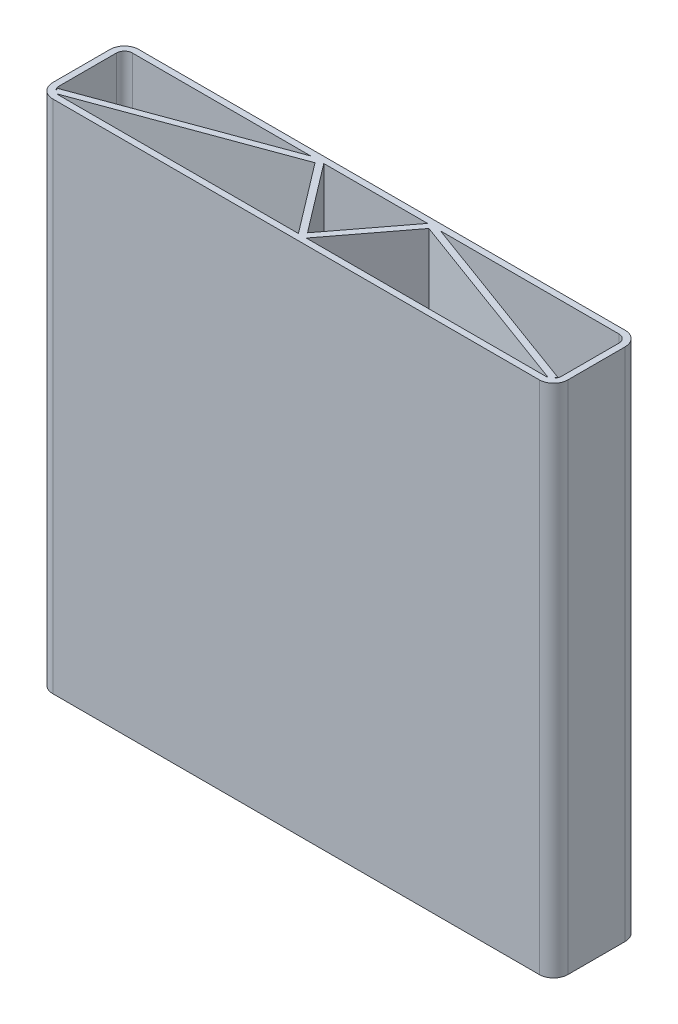
ISO-10303-21;
HEADER;
FILE_DESCRIPTION(('STEP AP214'),'2;1');
FILE_NAME('part.step','',(''),(''),'','','');
FILE_SCHEMA(('AUTOMOTIVE_DESIGN { 1 0 10303 214 1 1 1 1 }'));
ENDSEC;
DATA;
#1=APPLICATION_CONTEXT('core data for automotive mechanical design processes');
#2=APPLICATION_PROTOCOL_DEFINITION('international standard','automotive_design',2000,#1);
#3=PRODUCT_CONTEXT('',#1,'mechanical');
#4=PRODUCT('Part','Part','',(#3));
#5=PRODUCT_RELATED_PRODUCT_CATEGORY('part','',(#4));
#6=PRODUCT_DEFINITION_FORMATION('','',#4);
#7=PRODUCT_DEFINITION_CONTEXT('part definition',#1,'design');
#8=PRODUCT_DEFINITION('design','',#6,#7);
#9=PRODUCT_DEFINITION_SHAPE('','',#8);
#10=(LENGTH_UNIT() NAMED_UNIT(*) SI_UNIT(.MILLI.,.METRE.));
#11=(NAMED_UNIT(*) PLANE_ANGLE_UNIT() SI_UNIT($,.RADIAN.));
#12=(NAMED_UNIT(*) SI_UNIT($,.STERADIAN.) SOLID_ANGLE_UNIT());
#13=UNCERTAINTY_MEASURE_WITH_UNIT(LENGTH_MEASURE(1.E-05),#10,'distance_accuracy_value','');
#14=(GEOMETRIC_REPRESENTATION_CONTEXT(3) GLOBAL_UNCERTAINTY_ASSIGNED_CONTEXT((#13)) GLOBAL_UNIT_ASSIGNED_CONTEXT((#10,
#11,#12)) REPRESENTATION_CONTEXT('',''));
#15=CARTESIAN_POINT('',(0.,0.,0.));
#16=DIRECTION('',(0.,0.,1.));
#17=DIRECTION('',(1.,0.,0.));
#18=AXIS2_PLACEMENT_3D('',#15,#16,#17);
#19=CARTESIAN_POINT('',(863.6,1828.8,-130.175));
#20=DIRECTION('',(0.,0.,1.));
#21=DIRECTION('',(1.,0.,0.));
#22=AXIS2_PLACEMENT_3D('',#19,#20,#21);
#23=PLANE('',#22);
#24=DIRECTION('',(-1.,0.,0.));
#25=VECTOR('',#24,1.);
#26=CARTESIAN_POINT('',(863.6,0.,-130.175));
#27=LINE('',#26,#25);
#28=CARTESIAN_POINT('',(-230.326612423652,0.,-130.175));
#29=VERTEX_POINT('',#28);
#30=CARTESIAN_POINT('',(-863.6,0.,-130.175));
#31=VERTEX_POINT('',#30);
#32=EDGE_CURVE('E430',#29,#31,#27,.T.);
#33=ORIENTED_EDGE('',*,*,#32,.F.);
#34=DIRECTION('',(0.,1.,0.));
#35=VECTOR('',#34,1.);
#36=CARTESIAN_POINT('',(-230.326612423652,1828.8,-130.175));
#37=LINE('',#36,#35);
#38=CARTESIAN_POINT('',(-230.326612423652,1828.8,-130.175));
#39=VERTEX_POINT('',#38);
#40=EDGE_CURVE('E12',#29,#39,#37,.T.);
#41=ORIENTED_EDGE('',*,*,#40,.T.);
#42=DIRECTION('',(-1.,0.,0.));
#43=VECTOR('',#42,1.);
#44=CARTESIAN_POINT('',(863.6,1828.8,-130.175));
#45=LINE('',#44,#43);
#46=CARTESIAN_POINT('',(-863.6,1828.8,-130.175));
#47=VERTEX_POINT('',#46);
#48=EDGE_CURVE('E402',#39,#47,#45,.T.);
#49=ORIENTED_EDGE('',*,*,#48,.T.);
#50=DIRECTION('',(0.,-1.,0.));
#51=VECTOR('',#50,1.);
#52=CARTESIAN_POINT('',(-863.6,1828.8,-130.175));
#53=LINE('',#52,#51);
#54=EDGE_CURVE('E481',#47,#31,#53,.T.);
#55=ORIENTED_EDGE('',*,*,#54,.T.);
#56=EDGE_LOOP('',(#33,#41,#49,#55));
#57=FACE_BOUND('',#56,.T.);
#58=ADVANCED_FACE('F87',(#57),#23,.T.);
#59=CARTESIAN_POINT('',(184.14593905282,1828.8,-130.175));
#60=VERTEX_POINT('',#59);
#61=CARTESIAN_POINT('',(-184.145939052819,1828.8,-130.175));
#62=VERTEX_POINT('',#61);
#63=EDGE_CURVE('E103',#60,#62,#45,.T.);
#64=ORIENTED_EDGE('',*,*,#63,.T.);
#65=DIRECTION('',(0.,-1.,0.));
#66=VECTOR('',#65,1.);
#67=CARTESIAN_POINT('',(-184.145939052819,1828.8,-130.175));
#68=LINE('',#67,#66);
#69=CARTESIAN_POINT('',(-184.145939052819,0.,-130.175));
#70=VERTEX_POINT('',#69);
#71=EDGE_CURVE('E96',#62,#70,#68,.T.);
#72=ORIENTED_EDGE('',*,*,#71,.T.);
#73=CARTESIAN_POINT('',(184.14593905282,0.,-130.175));
#74=VERTEX_POINT('',#73);
#75=EDGE_CURVE('E434',#74,#70,#27,.T.);
#76=ORIENTED_EDGE('',*,*,#75,.F.);
#77=DIRECTION('',(0.,1.,0.));
#78=VECTOR('',#77,1.);
#79=CARTESIAN_POINT('',(184.14593905282,1828.8,-130.175));
#80=LINE('',#79,#78);
#81=EDGE_CURVE('E595',#74,#60,#80,.T.);
#82=ORIENTED_EDGE('',*,*,#81,.T.);
#83=EDGE_LOOP('',(#64,#72,#76,#82));
#84=FACE_BOUND('',#83,.T.);
#85=ADVANCED_FACE('F599',(#84),#23,.T.);
#86=CARTESIAN_POINT('',(863.6,1828.8,-130.175));
#87=VERTEX_POINT('',#86);
#88=CARTESIAN_POINT('',(230.326612423653,1828.8,-130.175));
#89=VERTEX_POINT('',#88);
#90=EDGE_CURVE('E111',#87,#89,#45,.T.);
#91=ORIENTED_EDGE('',*,*,#90,.T.);
#92=DIRECTION('',(0.,-1.,0.));
#93=VECTOR('',#92,1.);
#94=CARTESIAN_POINT('',(230.326612423653,1828.8,-130.175));
#95=LINE('',#94,#93);
#96=CARTESIAN_POINT('',(230.326612423653,0.,-130.175));
#97=VERTEX_POINT('',#96);
#98=EDGE_CURVE('E592',#89,#97,#95,.T.);
#99=ORIENTED_EDGE('',*,*,#98,.T.);
#100=CARTESIAN_POINT('',(863.6,0.,-130.175));
#101=VERTEX_POINT('',#100);
#102=EDGE_CURVE('E300',#101,#97,#27,.T.);
#103=ORIENTED_EDGE('',*,*,#102,.F.);
#104=DIRECTION('',(0.,-1.,0.));
#105=VECTOR('',#104,1.);
#106=CARTESIAN_POINT('',(863.6,1828.8,-130.175));
#107=LINE('',#106,#105);
#108=EDGE_CURVE('E485',#87,#101,#107,.T.);
#109=ORIENTED_EDGE('',*,*,#108,.F.);
#110=EDGE_LOOP('',(#91,#99,#103,#109));
#111=FACE_BOUND('',#110,.T.);
#112=ADVANCED_FACE('F693',(#111),#23,.T.);
#113=CARTESIAN_POINT('',(-863.6,1828.8,101.6));
#114=DIRECTION('',(0.,-1.,0.));
#115=DIRECTION('',(0.,0.,-1.));
#116=AXIS2_PLACEMENT_3D('',#113,#114,#115);
#117=CYLINDRICAL_SURFACE('',#116,28.575);
#118=CARTESIAN_POINT('',(-863.6,1828.8,101.6));
#119=DIRECTION('',(0.,-1.,0.));
#120=DIRECTION('',(-1.,0.,0.));
#121=AXIS2_PLACEMENT_3D('',#118,#119,#120);
#122=CIRCLE('',#121,28.575);
#123=CARTESIAN_POINT('',(-892.175,1828.8,101.6));
#124=VERTEX_POINT('',#123);
#125=CARTESIAN_POINT('',(-883.805576272405,1828.8,121.805576272406));
#126=VERTEX_POINT('',#125);
#127=EDGE_CURVE('E413',#124,#126,#122,.F.);
#128=ORIENTED_EDGE('',*,*,#127,.T.);
#129=DIRECTION('',(0.,-1.,0.));
#130=VECTOR('',#129,1.);
#131=CARTESIAN_POINT('',(-883.805576272405,1828.8,121.805576272406));
#132=LINE('',#131,#130);
#133=CARTESIAN_POINT('',(-883.805576272405,0.,121.805576272406));
#134=VERTEX_POINT('',#133);
#135=EDGE_CURVE('E585',#126,#134,#132,.T.);
#136=ORIENTED_EDGE('',*,*,#135,.T.);
#137=CARTESIAN_POINT('',(-863.6,0.,101.6));
#138=DIRECTION('',(0.,-1.,0.));
#139=DIRECTION('',(-1.,0.,0.));
#140=AXIS2_PLACEMENT_3D('',#137,#138,#139);
#141=CIRCLE('',#140,28.575);
#142=CARTESIAN_POINT('',(-892.175,0.,101.6));
#143=VERTEX_POINT('',#142);
#144=EDGE_CURVE('E443',#143,#134,#141,.F.);
#145=ORIENTED_EDGE('',*,*,#144,.F.);
#146=DIRECTION('',(0.,-1.,0.));
#147=VECTOR('',#146,1.);
#148=CARTESIAN_POINT('',(-892.175,1828.8,101.6));
#149=LINE('',#148,#147);
#150=EDGE_CURVE('E475',#124,#143,#149,.T.);
#151=ORIENTED_EDGE('',*,*,#150,.F.);
#152=EDGE_LOOP('',(#128,#136,#145,#151));
#153=FACE_BOUND('',#152,.T.);
#154=ADVANCED_FACE('F636',(#153),#117,.F.);
#155=CARTESIAN_POINT('',(863.6,1828.8,130.175));
#156=DIRECTION('',(0.,0.,-1.));
#157=DIRECTION('',(-1.,0.,0.));
#158=AXIS2_PLACEMENT_3D('',#155,#156,#157);
#159=PLANE('',#158);
#160=DIRECTION('',(0.,-1.,0.));
#161=VECTOR('',#160,1.);
#162=CARTESIAN_POINT('',(13.963882693516,1828.8,130.175));
#163=LINE('',#162,#161);
#164=CARTESIAN_POINT('',(13.9638826935159,1828.8,130.175));
#165=VERTEX_POINT('',#164);
#166=CARTESIAN_POINT('',(13.9638826935159,0.,130.175));
#167=VERTEX_POINT('',#166);
#168=EDGE_CURVE('E581',#165,#167,#163,.T.);
#169=ORIENTED_EDGE('',*,*,#168,.F.);
#170=DIRECTION('',(1.,0.,0.));
#171=VECTOR('',#170,1.);
#172=CARTESIAN_POINT('',(863.6,1828.8,130.175));
#173=LINE('',#172,#171);
#174=CARTESIAN_POINT('',(863.6,1828.8,130.175));
#175=VERTEX_POINT('',#174);
#176=EDGE_CURVE('E416',#165,#175,#173,.T.);
#177=ORIENTED_EDGE('',*,*,#176,.T.);
#178=DIRECTION('',(0.,-1.,0.));
#179=VECTOR('',#178,1.);
#180=CARTESIAN_POINT('',(863.6,1828.8,130.175));
#181=LINE('',#180,#179);
#182=CARTESIAN_POINT('',(863.6,0.,130.175));
#183=VERTEX_POINT('',#182);
#184=EDGE_CURVE('E467',#175,#183,#181,.T.);
#185=ORIENTED_EDGE('',*,*,#184,.T.);
#186=DIRECTION('',(1.,0.,0.));
#187=VECTOR('',#186,1.);
#188=CARTESIAN_POINT('',(863.6,0.,130.175));
#189=LINE('',#188,#187);
#190=EDGE_CURVE('E447',#167,#183,#189,.T.);
#191=ORIENTED_EDGE('',*,*,#190,.F.);
#192=EDGE_LOOP('',(#169,#177,#185,#191));
#193=FACE_BOUND('',#192,.T.);
#194=ADVANCED_FACE('F703',(#193),#159,.T.);
#195=CARTESIAN_POINT('',(863.6,1828.8,101.6));
#196=DIRECTION('',(0.,-1.,0.));
#197=DIRECTION('',(0.,0.,-1.));
#198=AXIS2_PLACEMENT_3D('',#195,#196,#197);
#199=CYLINDRICAL_SURFACE('',#198,28.575);
#200=CARTESIAN_POINT('',(863.6,0.,101.6));
#201=DIRECTION('',(0.,-1.,0.));
#202=DIRECTION('',(-1.,0.,0.));
#203=AXIS2_PLACEMENT_3D('',#200,#201,#202);
#204=CIRCLE('',#203,28.575);
#205=CARTESIAN_POINT('',(883.805576272406,0.,121.805576272405));
#206=VERTEX_POINT('',#205);
#207=CARTESIAN_POINT('',(892.175,0.,101.6));
#208=VERTEX_POINT('',#207);
#209=EDGE_CURVE('E452',#206,#208,#204,.F.);
#210=ORIENTED_EDGE('',*,*,#209,.F.);
#211=DIRECTION('',(0.,-1.,0.));
#212=VECTOR('',#211,1.);
#213=CARTESIAN_POINT('',(883.805576272406,1828.8,121.805576272405));
#214=LINE('',#213,#212);
#215=CARTESIAN_POINT('',(883.805576272406,1828.8,121.805576272405));
#216=VERTEX_POINT('',#215);
#217=EDGE_CURVE('E320',#206,#216,#214,.F.);
#218=ORIENTED_EDGE('',*,*,#217,.T.);
#219=CARTESIAN_POINT('',(863.6,1828.8,101.6));
#220=DIRECTION('',(0.,-1.,0.));
#221=DIRECTION('',(-1.,0.,0.));
#222=AXIS2_PLACEMENT_3D('',#219,#220,#221);
#223=CIRCLE('',#222,28.575);
#224=CARTESIAN_POINT('',(892.175,1828.8,101.6));
#225=VERTEX_POINT('',#224);
#226=EDGE_CURVE('E420',#216,#225,#223,.F.);
#227=ORIENTED_EDGE('',*,*,#226,.T.);
#228=DIRECTION('',(0.,-1.,0.));
#229=VECTOR('',#228,1.);
#230=CARTESIAN_POINT('',(892.175,1828.8,101.6));
#231=LINE('',#230,#229);
#232=EDGE_CURVE('E463',#225,#208,#231,.T.);
#233=ORIENTED_EDGE('',*,*,#232,.T.);
#234=EDGE_LOOP('',(#210,#218,#227,#233));
#235=FACE_BOUND('',#234,.T.);
#236=ADVANCED_FACE('F648',(#235),#199,.F.);
#237=CARTESIAN_POINT('',(863.6,1828.8,-101.6));
#238=DIRECTION('',(0.,1.,0.));
#239=DIRECTION('',(0.,0.,1.));
#240=AXIS2_PLACEMENT_3D('',#237,#238,#239);
#241=PLANE('',#240);
#242=ORIENTED_EDGE('',*,*,#176,.F.);
#243=DIRECTION('',(0.60555557586321,0.,-0.795803018680488));
#244=VECTOR('',#243,1.);
#245=CARTESIAN_POINT('',(8.84336104508716,1828.8,136.90423633678));
#246=LINE('',#245,#244);
#247=CARTESIAN_POINT('',(201.982109296159,1828.8,-116.912927617621));
#248=VERTEX_POINT('',#247);
#249=EDGE_CURVE('E326',#165,#248,#246,.T.);
#250=ORIENTED_EDGE('',*,*,#249,.T.);
#251=DIRECTION('',(0.93862884060097,0.,0.344928832648241));
#252=VECTOR('',#251,1.);
#253=CARTESIAN_POINT('',(194.276800093532,1828.8,-119.744487008822));
#254=LINE('',#253,#252);
#255=CARTESIAN_POINT('',(871.406132754086,1828.8,129.088086809117));
#256=VERTEX_POINT('',#255);
#257=EDGE_CURVE('E351',#248,#256,#254,.T.);
#258=ORIENTED_EDGE('',*,*,#257,.T.);
#259=EDGE_CURVE('E421',#175,#256,#223,.F.);
#260=ORIENTED_EDGE('',*,*,#259,.F.);
#261=EDGE_LOOP('',(#242,#250,#258,#260));
#262=FACE_BOUND('',#261,.T.);
#263=CARTESIAN_POINT('',(-871.406132754086,1828.8,129.088086809118));
#264=VERTEX_POINT('',#263);
#265=CARTESIAN_POINT('',(-863.6,1828.8,130.175));
#266=VERTEX_POINT('',#265);
#267=EDGE_CURVE('E412',#264,#266,#122,.F.);
#268=ORIENTED_EDGE('',*,*,#267,.F.);
#269=DIRECTION('',(0.93862884060097,0.,-0.344928832648241));
#270=VECTOR('',#269,1.);
#271=CARTESIAN_POINT('',(-879.972554619602,1828.8,132.236089263584));
#272=LINE('',#271,#270);
#273=CARTESIAN_POINT('',(-201.982109296159,1828.8,-116.912927617621));
#274=VERTEX_POINT('',#273);
#275=EDGE_CURVE('E374',#264,#274,#272,.T.);
#276=ORIENTED_EDGE('',*,*,#275,.T.);
#277=DIRECTION('',(0.60555557586321,0.,0.795803018680488));
#278=VECTOR('',#277,1.);
#279=CARTESIAN_POINT('',(-206.953182791422,1828.8,-123.44576366322));
#280=LINE('',#279,#278);
#281=CARTESIAN_POINT('',(-13.9638826935155,1828.8,130.175));
#282=VERTEX_POINT('',#281);
#283=EDGE_CURVE('E377',#274,#282,#280,.T.);
#284=ORIENTED_EDGE('',*,*,#283,.T.);
#285=EDGE_CURVE('E417',#266,#282,#173,.T.);
#286=ORIENTED_EDGE('',*,*,#285,.F.);
#287=EDGE_LOOP('',(#268,#276,#284,#286));
#288=FACE_BOUND('',#287,.T.);
#289=DIRECTION('',(-0.344928832648237,0.,-0.938628840600972));
#290=VECTOR('',#289,1.);
#291=CARTESIAN_POINT('',(-879.972554619602,1828.8,132.236089263584));
#292=LINE('',#291,#290);
#293=CARTESIAN_POINT('',(-887.638597925209,1828.8,111.375063281227));
#294=VERTEX_POINT('',#293);
#295=EDGE_CURVE('E371',#126,#294,#292,.T.);
#296=ORIENTED_EDGE('',*,*,#295,.F.);
#297=ORIENTED_EDGE('',*,*,#127,.F.);
#298=DIRECTION('',(0.,0.,1.));
#299=VECTOR('',#298,1.);
#300=CARTESIAN_POINT('',(-892.175,1828.8,-101.6));
#301=LINE('',#300,#299);
#302=CARTESIAN_POINT('',(-892.175,1828.8,-101.6));
#303=VERTEX_POINT('',#302);
#304=EDGE_CURVE('E409',#303,#124,#301,.T.);
#305=ORIENTED_EDGE('',*,*,#304,.F.);
#306=CARTESIAN_POINT('',(-863.6,1828.8,-101.6));
#307=DIRECTION('',(0.,-1.,0.));
#308=DIRECTION('',(-1.,0.,0.));
#309=AXIS2_PLACEMENT_3D('',#306,#307,#308);
#310=CIRCLE('',#309,28.575);
#311=EDGE_CURVE('E406',#47,#303,#310,.F.);
#312=ORIENTED_EDGE('',*,*,#311,.F.);
#313=ORIENTED_EDGE('',*,*,#48,.F.);
#314=DIRECTION('',(0.93862884060097,0.,-0.344928832648241));
#315=VECTOR('',#314,1.);
#316=CARTESIAN_POINT('',(-887.638597925209,1828.8,111.375063281227));
#317=LINE('',#316,#315);
#318=EDGE_CURVE('E367',#294,#39,#317,.T.);
#319=ORIENTED_EDGE('',*,*,#318,.F.);
#320=EDGE_LOOP('',(#296,#297,#305,#312,#313,#319));
#321=FACE_BOUND('',#320,.T.);
#322=DIRECTION('',(0.60555557586321,0.,0.795803018680488));
#323=VECTOR('',#322,1.);
#324=CARTESIAN_POINT('',(-189.266460701248,1828.8,-136.90423633678));
#325=LINE('',#324,#323);
#326=CARTESIAN_POINT('',(2.38524477946811E-13,1828.8,111.824083184216));
#327=VERTEX_POINT('',#326);
#328=EDGE_CURVE('E364',#62,#327,#325,.T.);
#329=ORIENTED_EDGE('',*,*,#328,.F.);
#330=ORIENTED_EDGE('',*,*,#63,.F.);
#331=DIRECTION('',(0.60555557586321,0.,-0.795803018680488));
#332=VECTOR('',#331,1.);
#333=CARTESIAN_POINT('',(-8.84336104508667,1828.8,123.44576366322));
#334=LINE('',#333,#332);
#335=EDGE_CURVE('E360',#327,#60,#334,.T.);
#336=ORIENTED_EDGE('',*,*,#335,.F.);
#337=EDGE_LOOP('',(#329,#330,#336));
#338=FACE_BOUND('',#337,.T.);
#339=DIRECTION('',(0.93862884060097,0.,0.344928832648241));
#340=VECTOR('',#339,1.);
#341=CARTESIAN_POINT('',(201.942843399139,1828.8,-140.605512991178));
#342=LINE('',#341,#340);
#343=CARTESIAN_POINT('',(887.63859792521,1828.8,111.375063281227));
#344=VERTEX_POINT('',#343);
#345=EDGE_CURVE('E309',#89,#344,#342,.T.);
#346=ORIENTED_EDGE('',*,*,#345,.F.);
#347=ORIENTED_EDGE('',*,*,#90,.F.);
#348=CARTESIAN_POINT('',(863.6,1828.8,-101.6));
#349=DIRECTION('',(0.,-1.,0.));
#350=DIRECTION('',(-1.,0.,0.));
#351=AXIS2_PLACEMENT_3D('',#348,#349,#350);
#352=CIRCLE('',#351,28.575);
#353=CARTESIAN_POINT('',(892.175,1828.8,-101.6));
#354=VERTEX_POINT('',#353);
#355=EDGE_CURVE('E399',#354,#87,#352,.F.);
#356=ORIENTED_EDGE('',*,*,#355,.F.);
#357=DIRECTION('',(0.,0.,-1.));
#358=VECTOR('',#357,1.);
#359=CARTESIAN_POINT('',(892.175,1828.8,-101.6));
#360=LINE('',#359,#358);
#361=EDGE_CURVE('E424',#225,#354,#360,.T.);
#362=ORIENTED_EDGE('',*,*,#361,.F.);
#363=ORIENTED_EDGE('',*,*,#226,.F.);
#364=DIRECTION('',(-0.344928832648246,0.,0.938628840600969));
#365=VECTOR('',#364,1.);
#366=CARTESIAN_POINT('',(887.63859792521,1828.8,111.375063281227));
#367=LINE('',#366,#365);
#368=EDGE_CURVE('E355',#344,#216,#367,.T.);
#369=ORIENTED_EDGE('',*,*,#368,.F.);
#370=EDGE_LOOP('',(#346,#347,#356,#362,#363,#369));
#371=FACE_BOUND('',#370,.T.);
#372=CARTESIAN_POINT('',(863.6,1828.8,-101.6));
#373=DIRECTION('',(0.,1.,0.));
#374=DIRECTION('',(0.,0.,-1.));
#375=AXIS2_PLACEMENT_3D('',#372,#373,#374);
#376=CIRCLE('',#375,50.8);
#377=CARTESIAN_POINT('',(914.4,1828.8,-101.6));
#378=VERTEX_POINT('',#377);
#379=CARTESIAN_POINT('',(863.6,1828.8,-152.4));
#380=VERTEX_POINT('',#379);
#381=EDGE_CURVE('E490',#378,#380,#376,.T.);
#382=ORIENTED_EDGE('',*,*,#381,.T.);
#383=DIRECTION('',(-1.,0.,0.));
#384=VECTOR('',#383,1.);
#385=CARTESIAN_POINT('',(-863.6,1828.8,-152.4));
#386=LINE('',#385,#384);
#387=CARTESIAN_POINT('',(-863.6,1828.8,-152.4));
#388=VERTEX_POINT('',#387);
#389=EDGE_CURVE('E494',#380,#388,#386,.T.);
#390=ORIENTED_EDGE('',*,*,#389,.T.);
#391=CARTESIAN_POINT('',(-863.6,1828.8,-101.6));
#392=DIRECTION('',(0.,1.,0.));
#393=DIRECTION('',(0.,0.,1.));
#394=AXIS2_PLACEMENT_3D('',#391,#392,#393);
#395=CIRCLE('',#394,50.8);
#396=CARTESIAN_POINT('',(-914.4,1828.8,-101.6));
#397=VERTEX_POINT('',#396);
#398=EDGE_CURVE('E498',#388,#397,#395,.T.);
#399=ORIENTED_EDGE('',*,*,#398,.T.);
#400=DIRECTION('',(0.,0.,1.));
#401=VECTOR('',#400,1.);
#402=CARTESIAN_POINT('',(-914.4,1828.8,-101.6));
#403=LINE('',#402,#401);
#404=CARTESIAN_POINT('',(-914.4,1828.8,101.6));
#405=VERTEX_POINT('',#404);
#406=EDGE_CURVE('E501',#397,#405,#403,.T.);
#407=ORIENTED_EDGE('',*,*,#406,.T.);
#408=CARTESIAN_POINT('',(-863.6,1828.8,101.6));
#409=DIRECTION('',(0.,1.,0.));
#410=DIRECTION('',(0.,0.,1.));
#411=AXIS2_PLACEMENT_3D('',#408,#409,#410);
#412=CIRCLE('',#411,50.8);
#413=CARTESIAN_POINT('',(-863.6,1828.8,152.4));
#414=VERTEX_POINT('',#413);
#415=EDGE_CURVE('E504',#405,#414,#412,.T.);
#416=ORIENTED_EDGE('',*,*,#415,.T.);
#417=DIRECTION('',(1.,0.,0.));
#418=VECTOR('',#417,1.);
#419=CARTESIAN_POINT('',(-863.6,1828.8,152.4));
#420=LINE('',#419,#418);
#421=CARTESIAN_POINT('',(863.6,1828.8,152.4));
#422=VERTEX_POINT('',#421);
#423=EDGE_CURVE('E507',#414,#422,#420,.T.);
#424=ORIENTED_EDGE('',*,*,#423,.T.);
#425=CARTESIAN_POINT('',(863.6,1828.8,101.6));
#426=DIRECTION('',(0.,1.,0.));
#427=DIRECTION('',(0.,0.,1.));
#428=AXIS2_PLACEMENT_3D('',#425,#426,#427);
#429=CIRCLE('',#428,50.8);
#430=CARTESIAN_POINT('',(914.4,1828.8,101.6));
#431=VERTEX_POINT('',#430);
#432=EDGE_CURVE('E510',#422,#431,#429,.T.);
#433=ORIENTED_EDGE('',*,*,#432,.T.);
#434=DIRECTION('',(0.,0.,-1.));
#435=VECTOR('',#434,1.);
#436=CARTESIAN_POINT('',(914.4,1828.8,-101.6));
#437=LINE('',#436,#435);
#438=EDGE_CURVE('E513',#431,#378,#437,.T.);
#439=ORIENTED_EDGE('',*,*,#438,.T.);
#440=EDGE_LOOP('',(#382,#390,#399,#407,#416,#424,#433,#439));
#441=FACE_BOUND('',#440,.T.);
#442=ADVANCED_FACE('F613',(#262,#288,#321,#338,#371,#441),#241,.T.);
#443=CARTESIAN_POINT('',(863.6,0.,-101.6));
#444=DIRECTION('',(0.,1.,0.));
#445=DIRECTION('',(0.,0.,1.));
#446=AXIS2_PLACEMENT_3D('',#443,#444,#445);
#447=PLANE('',#446);
#448=DIRECTION('',(0.60555557586321,0.,-0.795803018680488));
#449=VECTOR('',#448,1.);
#450=CARTESIAN_POINT('',(8.84336104508716,0.,136.90423633678));
#451=LINE('',#450,#449);
#452=CARTESIAN_POINT('',(201.982109296159,0.,-116.912927617621));
#453=VERTEX_POINT('',#452);
#454=EDGE_CURVE('E315',#167,#453,#451,.T.);
#455=ORIENTED_EDGE('',*,*,#454,.F.);
#456=ORIENTED_EDGE('',*,*,#190,.T.);
#457=CARTESIAN_POINT('',(871.406132754086,0.,129.088086809117));
#458=VERTEX_POINT('',#457);
#459=EDGE_CURVE('E453',#183,#458,#204,.F.);
#460=ORIENTED_EDGE('',*,*,#459,.T.);
#461=DIRECTION('',(0.93862884060097,0.,0.344928832648241));
#462=VECTOR('',#461,1.);
#463=CARTESIAN_POINT('',(194.276800093532,0.,-119.744487008822));
#464=LINE('',#463,#462);
#465=EDGE_CURVE('E322',#453,#458,#464,.T.);
#466=ORIENTED_EDGE('',*,*,#465,.F.);
#467=EDGE_LOOP('',(#455,#456,#460,#466));
#468=FACE_BOUND('',#467,.T.);
#469=DIRECTION('',(0.93862884060097,0.,-0.344928832648241));
#470=VECTOR('',#469,1.);
#471=CARTESIAN_POINT('',(-879.972554619602,0.,132.236089263584));
#472=LINE('',#471,#470);
#473=CARTESIAN_POINT('',(-871.406132754086,0.,129.088086809118));
#474=VERTEX_POINT('',#473);
#475=CARTESIAN_POINT('',(-201.982109296159,0.,-116.912927617621));
#476=VERTEX_POINT('',#475);
#477=EDGE_CURVE('E342',#474,#476,#472,.T.);
#478=ORIENTED_EDGE('',*,*,#477,.F.);
#479=CARTESIAN_POINT('',(-863.6,0.,130.175));
#480=VERTEX_POINT('',#479);
#481=EDGE_CURVE('E442',#474,#480,#141,.F.);
#482=ORIENTED_EDGE('',*,*,#481,.T.);
#483=CARTESIAN_POINT('',(-13.9638826935155,0.,130.175));
#484=VERTEX_POINT('',#483);
#485=EDGE_CURVE('E448',#480,#484,#189,.T.);
#486=ORIENTED_EDGE('',*,*,#485,.T.);
#487=DIRECTION('',(0.60555557586321,0.,0.795803018680488));
#488=VECTOR('',#487,1.);
#489=CARTESIAN_POINT('',(-206.953182791422,0.,-123.44576366322));
#490=LINE('',#489,#488);
#491=EDGE_CURVE('E345',#476,#484,#490,.T.);
#492=ORIENTED_EDGE('',*,*,#491,.F.);
#493=EDGE_LOOP('',(#478,#482,#486,#492));
#494=FACE_BOUND('',#493,.T.);
#495=ORIENTED_EDGE('',*,*,#144,.T.);
#496=DIRECTION('',(-0.344928832648237,0.,-0.938628840600972));
#497=VECTOR('',#496,1.);
#498=CARTESIAN_POINT('',(-879.972554619602,0.,132.236089263584));
#499=LINE('',#498,#497);
#500=CARTESIAN_POINT('',(-887.638597925209,0.,111.375063281227));
#501=VERTEX_POINT('',#500);
#502=EDGE_CURVE('E339',#134,#501,#499,.T.);
#503=ORIENTED_EDGE('',*,*,#502,.T.);
#504=DIRECTION('',(0.93862884060097,0.,-0.344928832648241));
#505=VECTOR('',#504,1.);
#506=CARTESIAN_POINT('',(-887.638597925209,0.,111.375063281227));
#507=LINE('',#506,#505);
#508=EDGE_CURVE('E335',#501,#29,#507,.T.);
#509=ORIENTED_EDGE('',*,*,#508,.T.);
#510=ORIENTED_EDGE('',*,*,#32,.T.);
#511=CARTESIAN_POINT('',(-863.6,0.,-101.6));
#512=DIRECTION('',(0.,-1.,0.));
#513=DIRECTION('',(-1.,0.,0.));
#514=AXIS2_PLACEMENT_3D('',#511,#512,#513);
#515=CIRCLE('',#514,28.575);
#516=CARTESIAN_POINT('',(-892.175,0.,-101.6));
#517=VERTEX_POINT('',#516);
#518=EDGE_CURVE('E433',#31,#517,#515,.F.);
#519=ORIENTED_EDGE('',*,*,#518,.T.);
#520=DIRECTION('',(0.,0.,1.));
#521=VECTOR('',#520,1.);
#522=CARTESIAN_POINT('',(-892.175,0.,-101.6));
#523=LINE('',#522,#521);
#524=EDGE_CURVE('E438',#517,#143,#523,.T.);
#525=ORIENTED_EDGE('',*,*,#524,.T.);
#526=EDGE_LOOP('',(#495,#503,#509,#510,#519,#525));
#527=FACE_BOUND('',#526,.T.);
#528=ORIENTED_EDGE('',*,*,#75,.T.);
#529=DIRECTION('',(0.60555557586321,0.,0.795803018680488));
#530=VECTOR('',#529,1.);
#531=CARTESIAN_POINT('',(-189.266460701248,0.,-136.90423633678));
#532=LINE('',#531,#530);
#533=CARTESIAN_POINT('',(2.38524477946811E-13,0.,111.824083184216));
#534=VERTEX_POINT('',#533);
#535=EDGE_CURVE('E332',#70,#534,#532,.T.);
#536=ORIENTED_EDGE('',*,*,#535,.T.);
#537=DIRECTION('',(0.60555557586321,0.,-0.795803018680488));
#538=VECTOR('',#537,1.);
#539=CARTESIAN_POINT('',(-8.84336104508667,0.,123.44576366322));
#540=LINE('',#539,#538);
#541=EDGE_CURVE('E303',#534,#74,#540,.T.);
#542=ORIENTED_EDGE('',*,*,#541,.T.);
#543=EDGE_LOOP('',(#528,#536,#542));
#544=FACE_BOUND('',#543,.T.);
#545=ORIENTED_EDGE('',*,*,#102,.T.);
#546=DIRECTION('',(0.93862884060097,0.,0.344928832648241));
#547=VECTOR('',#546,1.);
#548=CARTESIAN_POINT('',(201.942843399139,0.,-140.605512991178));
#549=LINE('',#548,#547);
#550=CARTESIAN_POINT('',(887.63859792521,0.,111.375063281227));
#551=VERTEX_POINT('',#550);
#552=EDGE_CURVE('E293',#97,#551,#549,.T.);
#553=ORIENTED_EDGE('',*,*,#552,.T.);
#554=DIRECTION('',(-0.344928832648246,0.,0.938628840600969));
#555=VECTOR('',#554,1.);
#556=CARTESIAN_POINT('',(887.63859792521,0.,111.375063281227));
#557=LINE('',#556,#555);
#558=EDGE_CURVE('E298',#551,#206,#557,.T.);
#559=ORIENTED_EDGE('',*,*,#558,.T.);
#560=ORIENTED_EDGE('',*,*,#209,.T.);
#561=DIRECTION('',(0.,0.,-1.));
#562=VECTOR('',#561,1.);
#563=CARTESIAN_POINT('',(892.175,0.,-101.6));
#564=LINE('',#563,#562);
#565=CARTESIAN_POINT('',(892.175,0.,-101.6));
#566=VERTEX_POINT('',#565);
#567=EDGE_CURVE('E403',#208,#566,#564,.T.);
#568=ORIENTED_EDGE('',*,*,#567,.T.);
#569=CARTESIAN_POINT('',(863.6,0.,-101.6));
#570=DIRECTION('',(0.,-1.,0.));
#571=DIRECTION('',(-1.,0.,0.));
#572=AXIS2_PLACEMENT_3D('',#569,#570,#571);
#573=CIRCLE('',#572,28.575);
#574=EDGE_CURVE('E387',#566,#101,#573,.F.);
#575=ORIENTED_EDGE('',*,*,#574,.T.);
#576=EDGE_LOOP('',(#545,#553,#559,#560,#568,#575));
#577=FACE_BOUND('',#576,.T.);
#578=CARTESIAN_POINT('',(863.6,0.,-101.6));
#579=DIRECTION('',(0.,1.,0.));
#580=DIRECTION('',(0.,0.,-1.));
#581=AXIS2_PLACEMENT_3D('',#578,#579,#580);
#582=CIRCLE('',#581,50.8);
#583=CARTESIAN_POINT('',(914.4,0.,-101.6));
#584=VERTEX_POINT('',#583);
#585=CARTESIAN_POINT('',(863.6,0.,-152.4));
#586=VERTEX_POINT('',#585);
#587=EDGE_CURVE('E489',#584,#586,#582,.T.);
#588=ORIENTED_EDGE('',*,*,#587,.F.);
#589=DIRECTION('',(0.,0.,-1.));
#590=VECTOR('',#589,1.);
#591=CARTESIAN_POINT('',(914.4,0.,-101.6));
#592=LINE('',#591,#590);
#593=CARTESIAN_POINT('',(914.4,0.,101.6));
#594=VERTEX_POINT('',#593);
#595=EDGE_CURVE('E495',#594,#584,#592,.T.);
#596=ORIENTED_EDGE('',*,*,#595,.F.);
#597=CARTESIAN_POINT('',(863.6,0.,101.6));
#598=DIRECTION('',(0.,1.,0.));
#599=DIRECTION('',(0.,0.,1.));
#600=AXIS2_PLACEMENT_3D('',#597,#598,#599);
#601=CIRCLE('',#600,50.8);
#602=CARTESIAN_POINT('',(863.6,0.,152.4));
#603=VERTEX_POINT('',#602);
#604=EDGE_CURVE('E535',#603,#594,#601,.T.);
#605=ORIENTED_EDGE('',*,*,#604,.F.);
#606=DIRECTION('',(1.,0.,0.));
#607=VECTOR('',#606,1.);
#608=CARTESIAN_POINT('',(-863.6,0.,152.4));
#609=LINE('',#608,#607);
#610=CARTESIAN_POINT('',(-863.6,0.,152.4));
#611=VERTEX_POINT('',#610);
#612=EDGE_CURVE('E532',#611,#603,#609,.T.);
#613=ORIENTED_EDGE('',*,*,#612,.F.);
#614=CARTESIAN_POINT('',(-863.6,0.,101.6));
#615=DIRECTION('',(0.,1.,0.));
#616=DIRECTION('',(0.,0.,1.));
#617=AXIS2_PLACEMENT_3D('',#614,#615,#616);
#618=CIRCLE('',#617,50.8);
#619=CARTESIAN_POINT('',(-914.4,0.,101.6));
#620=VERTEX_POINT('',#619);
#621=EDGE_CURVE('E529',#620,#611,#618,.T.);
#622=ORIENTED_EDGE('',*,*,#621,.F.);
#623=DIRECTION('',(0.,0.,1.));
#624=VECTOR('',#623,1.);
#625=CARTESIAN_POINT('',(-914.4,0.,-101.6));
#626=LINE('',#625,#624);
#627=CARTESIAN_POINT('',(-914.4,0.,-101.6));
#628=VERTEX_POINT('',#627);
#629=EDGE_CURVE('E526',#628,#620,#626,.T.);
#630=ORIENTED_EDGE('',*,*,#629,.F.);
#631=CARTESIAN_POINT('',(-863.6,0.,-101.6));
#632=DIRECTION('',(0.,1.,0.));
#633=DIRECTION('',(0.,0.,1.));
#634=AXIS2_PLACEMENT_3D('',#631,#632,#633);
#635=CIRCLE('',#634,50.8);
#636=CARTESIAN_POINT('',(-863.6,0.,-152.4));
#637=VERTEX_POINT('',#636);
#638=EDGE_CURVE('E523',#637,#628,#635,.T.);
#639=ORIENTED_EDGE('',*,*,#638,.F.);
#640=DIRECTION('',(-1.,0.,0.));
#641=VECTOR('',#640,1.);
#642=CARTESIAN_POINT('',(-863.6,0.,-152.4));
#643=LINE('',#642,#641);
#644=EDGE_CURVE('E520',#586,#637,#643,.T.);
#645=ORIENTED_EDGE('',*,*,#644,.F.);
#646=EDGE_LOOP('',(#588,#596,#605,#613,#622,#630,#639,#645));
#647=FACE_BOUND('',#646,.T.);
#648=ADVANCED_FACE('F295',(#468,#494,#527,#544,#577,#647),#447,.F.);
#649=CARTESIAN_POINT('',(863.6,1828.8,-101.6));
#650=DIRECTION('',(0.,-1.,0.));
#651=DIRECTION('',(0.,0.,-1.));
#652=AXIS2_PLACEMENT_3D('',#649,#650,#651);
#653=CYLINDRICAL_SURFACE('',#652,50.8);
#654=ORIENTED_EDGE('',*,*,#587,.T.);
#655=DIRECTION('',(0.,-1.,0.));
#656=VECTOR('',#655,1.);
#657=CARTESIAN_POINT('',(863.6,1828.8,-152.4));
#658=LINE('',#657,#656);
#659=EDGE_CURVE('E567',#380,#586,#658,.T.);
#660=ORIENTED_EDGE('',*,*,#659,.F.);
#661=ORIENTED_EDGE('',*,*,#381,.F.);
#662=DIRECTION('',(0.,-1.,0.));
#663=VECTOR('',#662,1.);
#664=CARTESIAN_POINT('',(914.4,1828.8,-101.6));
#665=LINE('',#664,#663);
#666=EDGE_CURVE('E516',#378,#584,#665,.T.);
#667=ORIENTED_EDGE('',*,*,#666,.T.);
#668=EDGE_LOOP('',(#654,#660,#661,#667));
#669=FACE_BOUND('',#668,.T.);
#670=ADVANCED_FACE('F89',(#669),#653,.T.);
#671=CARTESIAN_POINT('',(-863.6,1828.8,-152.4));
#672=DIRECTION('',(0.,0.,1.));
#673=DIRECTION('',(1.,0.,0.));
#674=AXIS2_PLACEMENT_3D('',#671,#672,#673);
#675=PLANE('',#674);
#676=ORIENTED_EDGE('',*,*,#644,.T.);
#677=DIRECTION('',(0.,-1.,0.));
#678=VECTOR('',#677,1.);
#679=CARTESIAN_POINT('',(-863.6,1828.8,-152.4));
#680=LINE('',#679,#678);
#681=EDGE_CURVE('E563',#388,#637,#680,.T.);
#682=ORIENTED_EDGE('',*,*,#681,.F.);
#683=ORIENTED_EDGE('',*,*,#389,.F.);
#684=ORIENTED_EDGE('',*,*,#659,.T.);
#685=EDGE_LOOP('',(#676,#682,#683,#684));
#686=FACE_BOUND('',#685,.T.);
#687=ADVANCED_FACE('F754',(#686),#675,.F.);
#688=CARTESIAN_POINT('',(-863.6,1828.8,-101.6));
#689=DIRECTION('',(0.,-1.,0.));
#690=DIRECTION('',(0.,0.,-1.));
#691=AXIS2_PLACEMENT_3D('',#688,#689,#690);
#692=CYLINDRICAL_SURFACE('',#691,50.8);
#693=ORIENTED_EDGE('',*,*,#638,.T.);
#694=DIRECTION('',(0.,-1.,0.));
#695=VECTOR('',#694,1.);
#696=CARTESIAN_POINT('',(-914.4,1828.8,-101.6));
#697=LINE('',#696,#695);
#698=EDGE_CURVE('E559',#397,#628,#697,.T.);
#699=ORIENTED_EDGE('',*,*,#698,.F.);
#700=ORIENTED_EDGE('',*,*,#398,.F.);
#701=ORIENTED_EDGE('',*,*,#681,.T.);
#702=EDGE_LOOP('',(#693,#699,#700,#701));
#703=FACE_BOUND('',#702,.T.);
#704=ADVANCED_FACE('F751',(#703),#692,.T.);
#705=CARTESIAN_POINT('',(-914.4,1828.8,-101.6));
#706=DIRECTION('',(1.,0.,0.));
#707=DIRECTION('',(0.,0.,-1.));
#708=AXIS2_PLACEMENT_3D('',#705,#706,#707);
#709=PLANE('',#708);
#710=ORIENTED_EDGE('',*,*,#629,.T.);
#711=DIRECTION('',(0.,-1.,0.));
#712=VECTOR('',#711,1.);
#713=CARTESIAN_POINT('',(-914.4,1828.8,101.6));
#714=LINE('',#713,#712);
#715=EDGE_CURVE('E555',#405,#620,#714,.T.);
#716=ORIENTED_EDGE('',*,*,#715,.F.);
#717=ORIENTED_EDGE('',*,*,#406,.F.);
#718=ORIENTED_EDGE('',*,*,#698,.T.);
#719=EDGE_LOOP('',(#710,#716,#717,#718));
#720=FACE_BOUND('',#719,.T.);
#721=ADVANCED_FACE('F747',(#720),#709,.F.);
#722=CARTESIAN_POINT('',(-863.6,1828.8,101.6));
#723=DIRECTION('',(0.,-1.,0.));
#724=DIRECTION('',(0.,0.,-1.));
#725=AXIS2_PLACEMENT_3D('',#722,#723,#724);
#726=CYLINDRICAL_SURFACE('',#725,50.8);
#727=ORIENTED_EDGE('',*,*,#621,.T.);
#728=DIRECTION('',(0.,-1.,0.));
#729=VECTOR('',#728,1.);
#730=CARTESIAN_POINT('',(-863.6,1828.8,152.4));
#731=LINE('',#730,#729);
#732=EDGE_CURVE('E551',#414,#611,#731,.T.);
#733=ORIENTED_EDGE('',*,*,#732,.F.);
#734=ORIENTED_EDGE('',*,*,#415,.F.);
#735=ORIENTED_EDGE('',*,*,#715,.T.);
#736=EDGE_LOOP('',(#727,#733,#734,#735));
#737=FACE_BOUND('',#736,.T.);
#738=ADVANCED_FACE('F743',(#737),#726,.T.);
#739=CARTESIAN_POINT('',(-863.6,1828.8,152.4));
#740=DIRECTION('',(0.,0.,-1.));
#741=DIRECTION('',(-1.,0.,0.));
#742=AXIS2_PLACEMENT_3D('',#739,#740,#741);
#743=PLANE('',#742);
#744=ORIENTED_EDGE('',*,*,#612,.T.);
#745=DIRECTION('',(0.,-1.,0.));
#746=VECTOR('',#745,1.);
#747=CARTESIAN_POINT('',(863.6,1828.8,152.4));
#748=LINE('',#747,#746);
#749=EDGE_CURVE('E547',#422,#603,#748,.T.);
#750=ORIENTED_EDGE('',*,*,#749,.F.);
#751=ORIENTED_EDGE('',*,*,#423,.F.);
#752=ORIENTED_EDGE('',*,*,#732,.T.);
#753=EDGE_LOOP('',(#744,#750,#751,#752));
#754=FACE_BOUND('',#753,.T.);
#755=ADVANCED_FACE('F739',(#754),#743,.F.);
#756=CARTESIAN_POINT('',(863.6,1828.8,101.6));
#757=DIRECTION('',(0.,-1.,0.));
#758=DIRECTION('',(0.,0.,-1.));
#759=AXIS2_PLACEMENT_3D('',#756,#757,#758);
#760=CYLINDRICAL_SURFACE('',#759,50.8);
#761=ORIENTED_EDGE('',*,*,#604,.T.);
#762=DIRECTION('',(0.,-1.,0.));
#763=VECTOR('',#762,1.);
#764=CARTESIAN_POINT('',(914.4,1828.8,101.6));
#765=LINE('',#764,#763);
#766=EDGE_CURVE('E543',#431,#594,#765,.T.);
#767=ORIENTED_EDGE('',*,*,#766,.F.);
#768=ORIENTED_EDGE('',*,*,#432,.F.);
#769=ORIENTED_EDGE('',*,*,#749,.T.);
#770=EDGE_LOOP('',(#761,#767,#768,#769));
#771=FACE_BOUND('',#770,.T.);
#772=ADVANCED_FACE('F727',(#771),#760,.T.);
#773=CARTESIAN_POINT('',(914.4,1828.8,-101.6));
#774=DIRECTION('',(-1.,0.,0.));
#775=DIRECTION('',(0.,0.,1.));
#776=AXIS2_PLACEMENT_3D('',#773,#774,#775);
#777=PLANE('',#776);
#778=ORIENTED_EDGE('',*,*,#595,.T.);
#779=ORIENTED_EDGE('',*,*,#666,.F.);
#780=ORIENTED_EDGE('',*,*,#438,.F.);
#781=ORIENTED_EDGE('',*,*,#766,.T.);
#782=EDGE_LOOP('',(#778,#779,#780,#781));
#783=FACE_BOUND('',#782,.T.);
#784=ADVANCED_FACE('F723',(#783),#777,.F.);
#785=CARTESIAN_POINT('',(863.6,1828.8,-101.6));
#786=DIRECTION('',(0.,-1.,0.));
#787=DIRECTION('',(0.,0.,-1.));
#788=AXIS2_PLACEMENT_3D('',#785,#786,#787);
#789=CYLINDRICAL_SURFACE('',#788,28.575);
#790=ORIENTED_EDGE('',*,*,#574,.F.);
#791=DIRECTION('',(0.,-1.,0.));
#792=VECTOR('',#791,1.);
#793=CARTESIAN_POINT('',(892.175,1828.8,-101.6));
#794=LINE('',#793,#792);
#795=EDGE_CURVE('E427',#354,#566,#794,.T.);
#796=ORIENTED_EDGE('',*,*,#795,.F.);
#797=ORIENTED_EDGE('',*,*,#355,.T.);
#798=ORIENTED_EDGE('',*,*,#108,.T.);
#799=EDGE_LOOP('',(#790,#796,#797,#798));
#800=FACE_BOUND('',#799,.T.);
#801=ADVANCED_FACE('F655',(#800),#789,.F.);
#802=CARTESIAN_POINT('',(-863.6,1828.8,-101.6));
#803=DIRECTION('',(0.,-1.,0.));
#804=DIRECTION('',(0.,0.,-1.));
#805=AXIS2_PLACEMENT_3D('',#802,#803,#804);
#806=CYLINDRICAL_SURFACE('',#805,28.575);
#807=ORIENTED_EDGE('',*,*,#518,.F.);
#808=ORIENTED_EDGE('',*,*,#54,.F.);
#809=ORIENTED_EDGE('',*,*,#311,.T.);
#810=DIRECTION('',(0.,-1.,0.));
#811=VECTOR('',#810,1.);
#812=CARTESIAN_POINT('',(-892.175,1828.8,-101.6));
#813=LINE('',#812,#811);
#814=EDGE_CURVE('E478',#303,#517,#813,.T.);
#815=ORIENTED_EDGE('',*,*,#814,.T.);
#816=EDGE_LOOP('',(#807,#808,#809,#815));
#817=FACE_BOUND('',#816,.T.);
#818=ADVANCED_FACE('F625',(#817),#806,.F.);
#819=CARTESIAN_POINT('',(-892.175,1828.8,-101.6));
#820=DIRECTION('',(1.,0.,0.));
#821=DIRECTION('',(0.,0.,-1.));
#822=AXIS2_PLACEMENT_3D('',#819,#820,#821);
#823=PLANE('',#822);
#824=ORIENTED_EDGE('',*,*,#524,.F.);
#825=ORIENTED_EDGE('',*,*,#814,.F.);
#826=ORIENTED_EDGE('',*,*,#304,.T.);
#827=ORIENTED_EDGE('',*,*,#150,.T.);
#828=EDGE_LOOP('',(#824,#825,#826,#827));
#829=FACE_BOUND('',#828,.T.);
#830=ADVANCED_FACE('F633',(#829),#823,.T.);
#831=DIRECTION('',(0.,-1.,0.));
#832=VECTOR('',#831,1.);
#833=CARTESIAN_POINT('',(-871.406132754086,1828.8,129.088086809118));
#834=LINE('',#833,#832);
#835=EDGE_CURVE('E588',#264,#474,#834,.T.);
#836=ORIENTED_EDGE('',*,*,#835,.F.);
#837=ORIENTED_EDGE('',*,*,#267,.T.);
#838=DIRECTION('',(0.,-1.,0.));
#839=VECTOR('',#838,1.);
#840=CARTESIAN_POINT('',(-863.6,1828.8,130.175));
#841=LINE('',#840,#839);
#842=EDGE_CURVE('E471',#266,#480,#841,.T.);
#843=ORIENTED_EDGE('',*,*,#842,.T.);
#844=ORIENTED_EDGE('',*,*,#481,.F.);
#845=EDGE_LOOP('',(#836,#837,#843,#844));
#846=FACE_BOUND('',#845,.T.);
#847=ADVANCED_FACE('F663',(#846),#117,.F.);
#848=DIRECTION('',(0.,1.,0.));
#849=VECTOR('',#848,1.);
#850=CARTESIAN_POINT('',(-13.9638826935155,1828.8,130.175));
#851=LINE('',#850,#849);
#852=EDGE_CURVE('E577',#484,#282,#851,.T.);
#853=ORIENTED_EDGE('',*,*,#852,.F.);
#854=ORIENTED_EDGE('',*,*,#485,.F.);
#855=ORIENTED_EDGE('',*,*,#842,.F.);
#856=ORIENTED_EDGE('',*,*,#285,.T.);
#857=EDGE_LOOP('',(#853,#854,#855,#856));
#858=FACE_BOUND('',#857,.T.);
#859=ADVANCED_FACE('F669',(#858),#159,.T.);
#860=DIRECTION('',(0.,-1.,0.));
#861=VECTOR('',#860,1.);
#862=CARTESIAN_POINT('',(871.406132754086,1828.8,129.088086809118));
#863=LINE('',#862,#861);
#864=EDGE_CURVE('E573',#458,#256,#863,.F.);
#865=ORIENTED_EDGE('',*,*,#864,.F.);
#866=ORIENTED_EDGE('',*,*,#459,.F.);
#867=ORIENTED_EDGE('',*,*,#184,.F.);
#868=ORIENTED_EDGE('',*,*,#259,.T.);
#869=EDGE_LOOP('',(#865,#866,#867,#868));
#870=FACE_BOUND('',#869,.T.);
#871=ADVANCED_FACE('F716',(#870),#199,.F.);
#872=CARTESIAN_POINT('',(892.175,1828.8,-101.6));
#873=DIRECTION('',(-1.,0.,0.));
#874=DIRECTION('',(0.,0.,1.));
#875=AXIS2_PLACEMENT_3D('',#872,#873,#874);
#876=PLANE('',#875);
#877=ORIENTED_EDGE('',*,*,#567,.F.);
#878=ORIENTED_EDGE('',*,*,#232,.F.);
#879=ORIENTED_EDGE('',*,*,#361,.T.);
#880=ORIENTED_EDGE('',*,*,#795,.T.);
#881=EDGE_LOOP('',(#877,#878,#879,#880));
#882=FACE_BOUND('',#881,.T.);
#883=ADVANCED_FACE('F651',(#882),#876,.T.);
#884=CARTESIAN_POINT('',(194.276800093532,0.,-119.744487008822));
#885=DIRECTION('',(-0.344928832648241,0.,0.93862884060097));
#886=DIRECTION('',(0.93862884060097,0.,0.344928832648241));
#887=AXIS2_PLACEMENT_3D('',#884,#885,#886);
#888=PLANE('',#887);
#889=ORIENTED_EDGE('',*,*,#465,.T.);
#890=ORIENTED_EDGE('',*,*,#864,.T.);
#891=ORIENTED_EDGE('',*,*,#257,.F.);
#892=DIRECTION('',(0.,1.,0.));
#893=VECTOR('',#892,1.);
#894=CARTESIAN_POINT('',(201.982109296159,0.,-116.912927617621));
#895=LINE('',#894,#893);
#896=EDGE_CURVE('E383',#453,#248,#895,.T.);
#897=ORIENTED_EDGE('',*,*,#896,.F.);
#898=EDGE_LOOP('',(#889,#890,#891,#897));
#899=FACE_BOUND('',#898,.T.);
#900=ADVANCED_FACE('F830',(#899),#888,.T.);
#901=CARTESIAN_POINT('',(8.84336104508716,0.,136.90423633678));
#902=DIRECTION('',(0.795803018680488,0.,0.60555557586321));
#903=DIRECTION('',(0.60555557586321,0.,-0.795803018680488));
#904=AXIS2_PLACEMENT_3D('',#901,#902,#903);
#905=PLANE('',#904);
#906=ORIENTED_EDGE('',*,*,#249,.F.);
#907=ORIENTED_EDGE('',*,*,#168,.T.);
#908=ORIENTED_EDGE('',*,*,#454,.T.);
#909=ORIENTED_EDGE('',*,*,#896,.T.);
#910=EDGE_LOOP('',(#906,#907,#908,#909));
#911=FACE_BOUND('',#910,.T.);
#912=ADVANCED_FACE('F689',(#911),#905,.T.);
#913=CARTESIAN_POINT('',(-206.953182791422,0.,-123.44576366322));
#914=DIRECTION('',(-0.795803018680488,0.,0.60555557586321));
#915=DIRECTION('',(0.60555557586321,0.,0.795803018680488));
#916=AXIS2_PLACEMENT_3D('',#913,#914,#915);
#917=PLANE('',#916);
#918=ORIENTED_EDGE('',*,*,#491,.T.);
#919=ORIENTED_EDGE('',*,*,#852,.T.);
#920=ORIENTED_EDGE('',*,*,#283,.F.);
#921=DIRECTION('',(0.,1.,0.));
#922=VECTOR('',#921,1.);
#923=CARTESIAN_POINT('',(-201.982109296159,0.,-116.912927617621));
#924=LINE('',#923,#922);
#925=EDGE_CURVE('E388',#476,#274,#924,.T.);
#926=ORIENTED_EDGE('',*,*,#925,.F.);
#927=EDGE_LOOP('',(#918,#919,#920,#926));
#928=FACE_BOUND('',#927,.T.);
#929=ADVANCED_FACE('F673',(#928),#917,.T.);
#930=CARTESIAN_POINT('',(-879.972554619602,0.,132.236089263584));
#931=DIRECTION('',(0.344928832648241,0.,0.93862884060097));
#932=DIRECTION('',(0.93862884060097,0.,-0.344928832648241));
#933=AXIS2_PLACEMENT_3D('',#930,#931,#932);
#934=PLANE('',#933);
#935=ORIENTED_EDGE('',*,*,#275,.F.);
#936=ORIENTED_EDGE('',*,*,#835,.T.);
#937=ORIENTED_EDGE('',*,*,#477,.T.);
#938=ORIENTED_EDGE('',*,*,#925,.T.);
#939=EDGE_LOOP('',(#935,#936,#937,#938));
#940=FACE_BOUND('',#939,.T.);
#941=ADVANCED_FACE('F678',(#940),#934,.T.);
#942=CARTESIAN_POINT('',(-879.972554619602,0.,132.236089263584));
#943=DIRECTION('',(0.938628840600972,0.,-0.344928832648237));
#944=DIRECTION('',(-0.344928832648237,0.,-0.938628840600972));
#945=AXIS2_PLACEMENT_3D('',#942,#943,#944);
#946=PLANE('',#945);
#947=ORIENTED_EDGE('',*,*,#135,.F.);
#948=ORIENTED_EDGE('',*,*,#295,.T.);
#949=DIRECTION('',(0.,1.,0.));
#950=VECTOR('',#949,1.);
#951=CARTESIAN_POINT('',(-887.638597925209,0.,111.375063281227));
#952=LINE('',#951,#950);
#953=EDGE_CURVE('E392',#501,#294,#952,.T.);
#954=ORIENTED_EDGE('',*,*,#953,.F.);
#955=ORIENTED_EDGE('',*,*,#502,.F.);
#956=EDGE_LOOP('',(#947,#948,#954,#955));
#957=FACE_BOUND('',#956,.T.);
#958=ADVANCED_FACE('F680',(#957),#946,.F.);
#959=CARTESIAN_POINT('',(-887.638597925209,0.,111.375063281227));
#960=DIRECTION('',(0.344928832648241,0.,0.93862884060097));
#961=DIRECTION('',(0.93862884060097,0.,-0.344928832648241));
#962=AXIS2_PLACEMENT_3D('',#959,#960,#961);
#963=PLANE('',#962);
#964=ORIENTED_EDGE('',*,*,#40,.F.);
#965=ORIENTED_EDGE('',*,*,#508,.F.);
#966=ORIENTED_EDGE('',*,*,#953,.T.);
#967=ORIENTED_EDGE('',*,*,#318,.T.);
#968=EDGE_LOOP('',(#964,#965,#966,#967));
#969=FACE_BOUND('',#968,.T.);
#970=ADVANCED_FACE('F686',(#969),#963,.F.);
#971=CARTESIAN_POINT('',(-189.266460701248,0.,-136.90423633678));
#972=DIRECTION('',(-0.795803018680488,0.,0.60555557586321));
#973=DIRECTION('',(0.60555557586321,0.,0.795803018680488));
#974=AXIS2_PLACEMENT_3D('',#971,#972,#973);
#975=PLANE('',#974);
#976=ORIENTED_EDGE('',*,*,#71,.F.);
#977=ORIENTED_EDGE('',*,*,#328,.T.);
#978=DIRECTION('',(0.,1.,0.));
#979=VECTOR('',#978,1.);
#980=CARTESIAN_POINT('',(2.38524477946811E-13,0.,111.824083184216));
#981=LINE('',#980,#979);
#982=EDGE_CURVE('E314',#534,#327,#981,.T.);
#983=ORIENTED_EDGE('',*,*,#982,.F.);
#984=ORIENTED_EDGE('',*,*,#535,.F.);
#985=EDGE_LOOP('',(#976,#977,#983,#984));
#986=FACE_BOUND('',#985,.T.);
#987=ADVANCED_FACE('F608',(#986),#975,.F.);
#988=CARTESIAN_POINT('',(-8.84336104508667,0.,123.44576366322));
#989=DIRECTION('',(0.795803018680488,0.,0.60555557586321));
#990=DIRECTION('',(0.60555557586321,0.,-0.795803018680488));
#991=AXIS2_PLACEMENT_3D('',#988,#989,#990);
#992=PLANE('',#991);
#993=ORIENTED_EDGE('',*,*,#81,.F.);
#994=ORIENTED_EDGE('',*,*,#541,.F.);
#995=ORIENTED_EDGE('',*,*,#982,.T.);
#996=ORIENTED_EDGE('',*,*,#335,.T.);
#997=EDGE_LOOP('',(#993,#994,#995,#996));
#998=FACE_BOUND('',#997,.T.);
#999=ADVANCED_FACE('F611',(#998),#992,.F.);
#1000=CARTESIAN_POINT('',(201.942843399139,0.,-140.605512991178));
#1001=DIRECTION('',(-0.344928832648241,0.,0.93862884060097));
#1002=DIRECTION('',(0.93862884060097,0.,0.344928832648241));
#1003=AXIS2_PLACEMENT_3D('',#1000,#1001,#1002);
#1004=PLANE('',#1003);
#1005=ORIENTED_EDGE('',*,*,#98,.F.);
#1006=ORIENTED_EDGE('',*,*,#345,.T.);
#1007=DIRECTION('',(0.,1.,0.));
#1008=VECTOR('',#1007,1.);
#1009=CARTESIAN_POINT('',(887.63859792521,0.,111.375063281227));
#1010=LINE('',#1009,#1008);
#1011=EDGE_CURVE('E306',#551,#344,#1010,.T.);
#1012=ORIENTED_EDGE('',*,*,#1011,.F.);
#1013=ORIENTED_EDGE('',*,*,#552,.F.);
#1014=EDGE_LOOP('',(#1005,#1006,#1012,#1013));
#1015=FACE_BOUND('',#1014,.T.);
#1016=ADVANCED_FACE('F307',(#1015),#1004,.F.);
#1017=CARTESIAN_POINT('',(887.63859792521,0.,111.375063281227));
#1018=DIRECTION('',(-0.938628840600969,0.,-0.344928832648246));
#1019=DIRECTION('',(-0.344928832648246,0.,0.938628840600969));
#1020=AXIS2_PLACEMENT_3D('',#1017,#1018,#1019);
#1021=PLANE('',#1020);
#1022=ORIENTED_EDGE('',*,*,#217,.F.);
#1023=ORIENTED_EDGE('',*,*,#558,.F.);
#1024=ORIENTED_EDGE('',*,*,#1011,.T.);
#1025=ORIENTED_EDGE('',*,*,#368,.T.);
#1026=EDGE_LOOP('',(#1022,#1023,#1024,#1025));
#1027=FACE_BOUND('',#1026,.T.);
#1028=ADVANCED_FACE('F318',(#1027),#1021,.F.);
#1029=CLOSED_SHELL('',(#58,#85,#112,#154,#194,#236,#442,#648,#670,#687,#704,#721,#738,#755,#772,
#784,#801,#818,#830,#847,#859,#871,#883,#900,#912,#929,#941,#958,#970,#987,#999,#1016,#1028));
#1030=MANIFOLD_SOLID_BREP('B2',#1029);
#1031=ADVANCED_BREP_SHAPE_REPRESENTATION('',(#18,#1030),#14);
#1032=SHAPE_DEFINITION_REPRESENTATION(#9,#1031);
ENDSEC;
END-ISO-10303-21;
